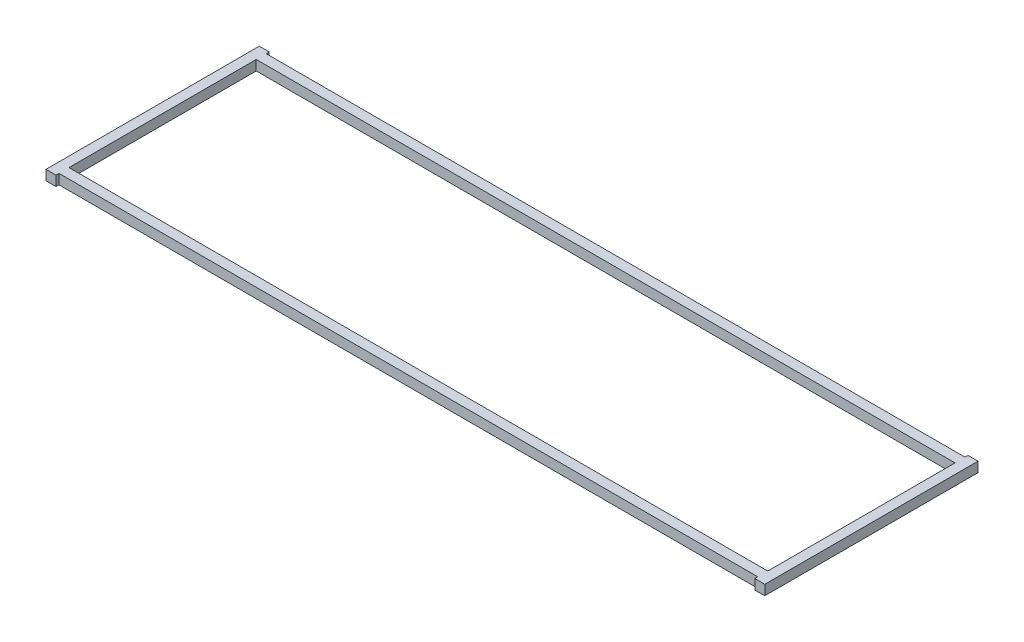
ISO-10303-21;
HEADER;
FILE_DESCRIPTION(('STEP AP214'),'2;1');
FILE_NAME('part.step','',(''),(''),'','','');
FILE_SCHEMA(('AUTOMOTIVE_DESIGN { 1 0 10303 214 1 1 1 1 }'));
ENDSEC;
DATA;
#1=APPLICATION_CONTEXT('core data for automotive mechanical design processes');
#2=APPLICATION_PROTOCOL_DEFINITION('international standard','automotive_design',2000,#1);
#3=PRODUCT_CONTEXT('',#1,'mechanical');
#4=PRODUCT('Part','Part','',(#3));
#5=PRODUCT_RELATED_PRODUCT_CATEGORY('part','',(#4));
#6=PRODUCT_DEFINITION_FORMATION('','',#4);
#7=PRODUCT_DEFINITION_CONTEXT('part definition',#1,'design');
#8=PRODUCT_DEFINITION('design','',#6,#7);
#9=PRODUCT_DEFINITION_SHAPE('','',#8);
#10=(LENGTH_UNIT() NAMED_UNIT(*) SI_UNIT(.MILLI.,.METRE.));
#11=(NAMED_UNIT(*) PLANE_ANGLE_UNIT() SI_UNIT($,.RADIAN.));
#12=(NAMED_UNIT(*) SI_UNIT($,.STERADIAN.) SOLID_ANGLE_UNIT());
#13=UNCERTAINTY_MEASURE_WITH_UNIT(LENGTH_MEASURE(1.E-05),#10,'distance_accuracy_value','');
#14=(GEOMETRIC_REPRESENTATION_CONTEXT(3) GLOBAL_UNCERTAINTY_ASSIGNED_CONTEXT((#13)) GLOBAL_UNIT_ASSIGNED_CONTEXT((#10,
#11,#12)) REPRESENTATION_CONTEXT('',''));
#15=CARTESIAN_POINT('',(0.,0.,0.));
#16=DIRECTION('',(0.,0.,1.));
#17=DIRECTION('',(1.,0.,0.));
#18=AXIS2_PLACEMENT_3D('',#15,#16,#17);
#19=CARTESIAN_POINT('',(0.,6.35,0.));
#20=DIRECTION('',(0.,-1.,0.));
#21=DIRECTION('',(0.,0.,-1.));
#22=AXIS2_PLACEMENT_3D('',#19,#20,#21);
#23=PLANE('',#22);
#24=DIRECTION('',(1.,0.,0.));
#25=VECTOR('',#24,1.);
#26=CARTESIAN_POINT('',(222.25,6.35,67.821175));
#27=LINE('',#26,#25);
#28=CARTESIAN_POINT('',(222.25,6.35,67.821175));
#29=VERTEX_POINT('',#28);
#30=CARTESIAN_POINT('',(228.6,6.35,67.821175));
#31=VERTEX_POINT('',#30);
#32=EDGE_CURVE('E186',#29,#31,#27,.T.);
#33=ORIENTED_EDGE('',*,*,#32,.T.);
#34=DIRECTION('',(0.,0.,-1.));
#35=VECTOR('',#34,1.);
#36=CARTESIAN_POINT('',(228.6,6.35,-67.821175));
#37=LINE('',#36,#35);
#38=CARTESIAN_POINT('',(228.6,6.35,-67.821175));
#39=VERTEX_POINT('',#38);
#40=EDGE_CURVE('E189',#31,#39,#37,.T.);
#41=ORIENTED_EDGE('',*,*,#40,.T.);
#42=DIRECTION('',(-1.,0.,0.));
#43=VECTOR('',#42,1.);
#44=CARTESIAN_POINT('',(222.25,6.35,-67.821175));
#45=LINE('',#44,#43);
#46=CARTESIAN_POINT('',(222.25,6.35,-67.821175));
#47=VERTEX_POINT('',#46);
#48=EDGE_CURVE('E192',#39,#47,#45,.T.);
#49=ORIENTED_EDGE('',*,*,#48,.T.);
#50=DIRECTION('',(0.,0.,1.));
#51=VECTOR('',#50,1.);
#52=CARTESIAN_POINT('',(222.25,6.35,-67.821175));
#53=LINE('',#52,#51);
#54=CARTESIAN_POINT('',(222.25,6.35,-65.913));
#55=VERTEX_POINT('',#54);
#56=EDGE_CURVE('E194',#47,#55,#53,.T.);
#57=ORIENTED_EDGE('',*,*,#56,.T.);
#58=DIRECTION('',(-1.,0.,0.));
#59=VECTOR('',#58,1.);
#60=CARTESIAN_POINT('',(-222.25,6.35,-65.913));
#61=LINE('',#60,#59);
#62=CARTESIAN_POINT('',(-222.25,6.35,-65.913));
#63=VERTEX_POINT('',#62);
#64=EDGE_CURVE('E196',#55,#63,#61,.T.);
#65=ORIENTED_EDGE('',*,*,#64,.T.);
#66=DIRECTION('',(0.,0.,-1.));
#67=VECTOR('',#66,1.);
#68=CARTESIAN_POINT('',(-222.25,6.35,-67.821175));
#69=LINE('',#68,#67);
#70=CARTESIAN_POINT('',(-222.25,6.35,-67.821175));
#71=VERTEX_POINT('',#70);
#72=EDGE_CURVE('E198',#63,#71,#69,.T.);
#73=ORIENTED_EDGE('',*,*,#72,.T.);
#74=DIRECTION('',(-1.,0.,0.));
#75=VECTOR('',#74,1.);
#76=CARTESIAN_POINT('',(-228.6,6.35,-67.821175));
#77=LINE('',#76,#75);
#78=CARTESIAN_POINT('',(-228.6,6.35,-67.821175));
#79=VERTEX_POINT('',#78);
#80=EDGE_CURVE('E200',#71,#79,#77,.T.);
#81=ORIENTED_EDGE('',*,*,#80,.T.);
#82=DIRECTION('',(0.,0.,1.));
#83=VECTOR('',#82,1.);
#84=CARTESIAN_POINT('',(-228.6,6.35,-67.821175));
#85=LINE('',#84,#83);
#86=CARTESIAN_POINT('',(-228.6,6.35,67.821175));
#87=VERTEX_POINT('',#86);
#88=EDGE_CURVE('E202',#79,#87,#85,.T.);
#89=ORIENTED_EDGE('',*,*,#88,.T.);
#90=DIRECTION('',(1.,0.,0.));
#91=VECTOR('',#90,1.);
#92=CARTESIAN_POINT('',(-228.6,6.35,67.821175));
#93=LINE('',#92,#91);
#94=CARTESIAN_POINT('',(-222.25,6.35,67.821175));
#95=VERTEX_POINT('',#94);
#96=EDGE_CURVE('E204',#87,#95,#93,.T.);
#97=ORIENTED_EDGE('',*,*,#96,.T.);
#98=DIRECTION('',(0.,0.,-1.));
#99=VECTOR('',#98,1.);
#100=CARTESIAN_POINT('',(-222.25,6.35,67.821175));
#101=LINE('',#100,#99);
#102=CARTESIAN_POINT('',(-222.25,6.35,65.913));
#103=VERTEX_POINT('',#102);
#104=EDGE_CURVE('E206',#95,#103,#101,.T.);
#105=ORIENTED_EDGE('',*,*,#104,.T.);
#106=DIRECTION('',(1.,0.,0.));
#107=VECTOR('',#106,1.);
#108=CARTESIAN_POINT('',(-222.25,6.35,65.913));
#109=LINE('',#108,#107);
#110=CARTESIAN_POINT('',(222.25,6.35,65.913));
#111=VERTEX_POINT('',#110);
#112=EDGE_CURVE('E208',#103,#111,#109,.T.);
#113=ORIENTED_EDGE('',*,*,#112,.T.);
#114=DIRECTION('',(0.,0.,1.));
#115=VECTOR('',#114,1.);
#116=CARTESIAN_POINT('',(222.25,6.35,67.821175));
#117=LINE('',#116,#115);
#118=EDGE_CURVE('E210',#111,#29,#117,.T.);
#119=ORIENTED_EDGE('',*,*,#118,.T.);
#120=EDGE_LOOP('',(#33,#41,#49,#57,#65,#73,#81,#89,#97,#105,#113,#119));
#121=FACE_BOUND('',#120,.T.);
#122=DIRECTION('',(0.,0.,-1.));
#123=VECTOR('',#122,1.);
#124=CARTESIAN_POINT('',(222.25,6.35,59.563));
#125=LINE('',#124,#123);
#126=CARTESIAN_POINT('',(222.25,6.35,59.563));
#127=VERTEX_POINT('',#126);
#128=CARTESIAN_POINT('',(222.25,6.35,-59.563));
#129=VERTEX_POINT('',#128);
#130=EDGE_CURVE('E150',#127,#129,#125,.T.);
#131=ORIENTED_EDGE('',*,*,#130,.F.);
#132=DIRECTION('',(1.,0.,0.));
#133=VECTOR('',#132,1.);
#134=CARTESIAN_POINT('',(-222.25,6.35,59.563));
#135=LINE('',#134,#133);
#136=CARTESIAN_POINT('',(-222.25,6.35,59.563));
#137=VERTEX_POINT('',#136);
#138=EDGE_CURVE('E172',#137,#127,#135,.T.);
#139=ORIENTED_EDGE('',*,*,#138,.F.);
#140=DIRECTION('',(0.,0.,1.));
#141=VECTOR('',#140,1.);
#142=CARTESIAN_POINT('',(-222.25,6.35,59.563));
#143=LINE('',#142,#141);
#144=CARTESIAN_POINT('',(-222.25,6.35,-59.563));
#145=VERTEX_POINT('',#144);
#146=EDGE_CURVE('E170',#145,#137,#143,.T.);
#147=ORIENTED_EDGE('',*,*,#146,.F.);
#148=DIRECTION('',(-1.,0.,0.));
#149=VECTOR('',#148,1.);
#150=CARTESIAN_POINT('',(-222.25,6.35,-59.563));
#151=LINE('',#150,#149);
#152=EDGE_CURVE('E158',#129,#145,#151,.T.);
#153=ORIENTED_EDGE('',*,*,#152,.F.);
#154=EDGE_LOOP('',(#131,#139,#147,#153));
#155=FACE_BOUND('',#154,.T.);
#156=ADVANCED_FACE('F37',(#121,#155),#23,.F.);
#157=CARTESIAN_POINT('',(0.,0.,0.));
#158=DIRECTION('',(0.,-1.,0.));
#159=DIRECTION('',(0.,0.,-1.));
#160=AXIS2_PLACEMENT_3D('',#157,#158,#159);
#161=PLANE('',#160);
#162=DIRECTION('',(1.,0.,0.));
#163=VECTOR('',#162,1.);
#164=CARTESIAN_POINT('',(222.25,0.,67.821175));
#165=LINE('',#164,#163);
#166=CARTESIAN_POINT('',(222.25,0.,67.821175));
#167=VERTEX_POINT('',#166);
#168=CARTESIAN_POINT('',(228.6,0.,67.821175));
#169=VERTEX_POINT('',#168);
#170=EDGE_CURVE('E166',#167,#169,#165,.T.);
#171=ORIENTED_EDGE('',*,*,#170,.F.);
#172=DIRECTION('',(0.,0.,1.));
#173=VECTOR('',#172,1.);
#174=CARTESIAN_POINT('',(222.25,0.,67.821175));
#175=LINE('',#174,#173);
#176=CARTESIAN_POINT('',(222.25,0.,65.913));
#177=VERTEX_POINT('',#176);
#178=EDGE_CURVE('E190',#177,#167,#175,.T.);
#179=ORIENTED_EDGE('',*,*,#178,.F.);
#180=DIRECTION('',(1.,0.,0.));
#181=VECTOR('',#180,1.);
#182=CARTESIAN_POINT('',(-222.25,0.,65.913));
#183=LINE('',#182,#181);
#184=CARTESIAN_POINT('',(-222.25,0.,65.913));
#185=VERTEX_POINT('',#184);
#186=EDGE_CURVE('E233',#185,#177,#183,.T.);
#187=ORIENTED_EDGE('',*,*,#186,.F.);
#188=DIRECTION('',(0.,0.,-1.));
#189=VECTOR('',#188,1.);
#190=CARTESIAN_POINT('',(-222.25,0.,67.821175));
#191=LINE('',#190,#189);
#192=CARTESIAN_POINT('',(-222.25,0.,67.821175));
#193=VERTEX_POINT('',#192);
#194=EDGE_CURVE('E231',#193,#185,#191,.T.);
#195=ORIENTED_EDGE('',*,*,#194,.F.);
#196=DIRECTION('',(1.,0.,0.));
#197=VECTOR('',#196,1.);
#198=CARTESIAN_POINT('',(-228.6,0.,67.821175));
#199=LINE('',#198,#197);
#200=CARTESIAN_POINT('',(-228.6,0.,67.821175));
#201=VERTEX_POINT('',#200);
#202=EDGE_CURVE('E229',#201,#193,#199,.T.);
#203=ORIENTED_EDGE('',*,*,#202,.F.);
#204=DIRECTION('',(0.,0.,1.));
#205=VECTOR('',#204,1.);
#206=CARTESIAN_POINT('',(-228.6,0.,-67.821175));
#207=LINE('',#206,#205);
#208=CARTESIAN_POINT('',(-228.6,0.,-67.821175));
#209=VERTEX_POINT('',#208);
#210=EDGE_CURVE('E227',#209,#201,#207,.T.);
#211=ORIENTED_EDGE('',*,*,#210,.F.);
#212=DIRECTION('',(-1.,0.,0.));
#213=VECTOR('',#212,1.);
#214=CARTESIAN_POINT('',(-228.6,0.,-67.821175));
#215=LINE('',#214,#213);
#216=CARTESIAN_POINT('',(-222.25,0.,-67.821175));
#217=VERTEX_POINT('',#216);
#218=EDGE_CURVE('E225',#217,#209,#215,.T.);
#219=ORIENTED_EDGE('',*,*,#218,.F.);
#220=DIRECTION('',(0.,0.,-1.));
#221=VECTOR('',#220,1.);
#222=CARTESIAN_POINT('',(-222.25,0.,-67.821175));
#223=LINE('',#222,#221);
#224=CARTESIAN_POINT('',(-222.25,0.,-65.913));
#225=VERTEX_POINT('',#224);
#226=EDGE_CURVE('E223',#225,#217,#223,.T.);
#227=ORIENTED_EDGE('',*,*,#226,.F.);
#228=DIRECTION('',(-1.,0.,0.));
#229=VECTOR('',#228,1.);
#230=CARTESIAN_POINT('',(-222.25,0.,-65.913));
#231=LINE('',#230,#229);
#232=CARTESIAN_POINT('',(222.25,0.,-65.913));
#233=VERTEX_POINT('',#232);
#234=EDGE_CURVE('E221',#233,#225,#231,.T.);
#235=ORIENTED_EDGE('',*,*,#234,.F.);
#236=DIRECTION('',(0.,0.,1.));
#237=VECTOR('',#236,1.);
#238=CARTESIAN_POINT('',(222.25,0.,-67.821175));
#239=LINE('',#238,#237);
#240=CARTESIAN_POINT('',(222.25,0.,-67.821175));
#241=VERTEX_POINT('',#240);
#242=EDGE_CURVE('E219',#241,#233,#239,.T.);
#243=ORIENTED_EDGE('',*,*,#242,.F.);
#244=DIRECTION('',(-1.,0.,0.));
#245=VECTOR('',#244,1.);
#246=CARTESIAN_POINT('',(222.25,0.,-67.821175));
#247=LINE('',#246,#245);
#248=CARTESIAN_POINT('',(228.6,0.,-67.821175));
#249=VERTEX_POINT('',#248);
#250=EDGE_CURVE('E217',#249,#241,#247,.T.);
#251=ORIENTED_EDGE('',*,*,#250,.F.);
#252=DIRECTION('',(0.,0.,-1.));
#253=VECTOR('',#252,1.);
#254=CARTESIAN_POINT('',(228.6,0.,-67.821175));
#255=LINE('',#254,#253);
#256=EDGE_CURVE('E215',#169,#249,#255,.T.);
#257=ORIENTED_EDGE('',*,*,#256,.F.);
#258=EDGE_LOOP('',(#171,#179,#187,#195,#203,#211,#219,#227,#235,#243,#251,#257));
#259=FACE_BOUND('',#258,.T.);
#260=DIRECTION('',(1.,0.,0.));
#261=VECTOR('',#260,1.);
#262=CARTESIAN_POINT('',(-222.25,0.,59.563));
#263=LINE('',#262,#261);
#264=CARTESIAN_POINT('',(-222.25,0.,59.563));
#265=VERTEX_POINT('',#264);
#266=CARTESIAN_POINT('',(222.25,0.,59.563));
#267=VERTEX_POINT('',#266);
#268=EDGE_CURVE('E159',#265,#267,#263,.T.);
#269=ORIENTED_EDGE('',*,*,#268,.T.);
#270=DIRECTION('',(0.,0.,-1.));
#271=VECTOR('',#270,1.);
#272=CARTESIAN_POINT('',(222.25,0.,59.563));
#273=LINE('',#272,#271);
#274=CARTESIAN_POINT('',(222.25,0.,-59.563));
#275=VERTEX_POINT('',#274);
#276=EDGE_CURVE('E60',#267,#275,#273,.T.);
#277=ORIENTED_EDGE('',*,*,#276,.T.);
#278=DIRECTION('',(-1.,0.,0.));
#279=VECTOR('',#278,1.);
#280=CARTESIAN_POINT('',(-222.25,0.,-59.563));
#281=LINE('',#280,#279);
#282=CARTESIAN_POINT('',(-222.25,0.,-59.563));
#283=VERTEX_POINT('',#282);
#284=EDGE_CURVE('E165',#275,#283,#281,.T.);
#285=ORIENTED_EDGE('',*,*,#284,.T.);
#286=DIRECTION('',(0.,0.,1.));
#287=VECTOR('',#286,1.);
#288=CARTESIAN_POINT('',(-222.25,0.,59.563));
#289=LINE('',#288,#287);
#290=EDGE_CURVE('E178',#283,#265,#289,.T.);
#291=ORIENTED_EDGE('',*,*,#290,.T.);
#292=EDGE_LOOP('',(#269,#277,#285,#291));
#293=FACE_BOUND('',#292,.T.);
#294=ADVANCED_FACE('F275',(#259,#293),#161,.T.);
#295=CARTESIAN_POINT('',(222.25,6.35,67.821175));
#296=DIRECTION('',(0.,0.,-1.));
#297=DIRECTION('',(-1.,0.,0.));
#298=AXIS2_PLACEMENT_3D('',#295,#296,#297);
#299=PLANE('',#298);
#300=ORIENTED_EDGE('',*,*,#170,.T.);
#301=DIRECTION('',(0.,-1.,0.));
#302=VECTOR('',#301,1.);
#303=CARTESIAN_POINT('',(228.6,6.35,67.821175));
#304=LINE('',#303,#302);
#305=EDGE_CURVE('E11',#31,#169,#304,.T.);
#306=ORIENTED_EDGE('',*,*,#305,.F.);
#307=ORIENTED_EDGE('',*,*,#32,.F.);
#308=DIRECTION('',(0.,-1.,0.));
#309=VECTOR('',#308,1.);
#310=CARTESIAN_POINT('',(222.25,6.35,67.821175));
#311=LINE('',#310,#309);
#312=EDGE_CURVE('E212',#29,#167,#311,.T.);
#313=ORIENTED_EDGE('',*,*,#312,.T.);
#314=EDGE_LOOP('',(#300,#306,#307,#313));
#315=FACE_BOUND('',#314,.T.);
#316=ADVANCED_FACE('F39',(#315),#299,.F.);
#317=CARTESIAN_POINT('',(228.6,6.35,-67.821175));
#318=DIRECTION('',(-1.,0.,0.));
#319=DIRECTION('',(0.,0.,1.));
#320=AXIS2_PLACEMENT_3D('',#317,#318,#319);
#321=PLANE('',#320);
#322=ORIENTED_EDGE('',*,*,#256,.T.);
#323=DIRECTION('',(0.,-1.,0.));
#324=VECTOR('',#323,1.);
#325=CARTESIAN_POINT('',(228.6,6.35,-67.821175));
#326=LINE('',#325,#324);
#327=EDGE_CURVE('E45',#39,#249,#326,.T.);
#328=ORIENTED_EDGE('',*,*,#327,.F.);
#329=ORIENTED_EDGE('',*,*,#40,.F.);
#330=ORIENTED_EDGE('',*,*,#305,.T.);
#331=EDGE_LOOP('',(#322,#328,#329,#330));
#332=FACE_BOUND('',#331,.T.);
#333=ADVANCED_FACE('F292',(#332),#321,.F.);
#334=CARTESIAN_POINT('',(222.25,6.35,-67.821175));
#335=DIRECTION('',(0.,0.,1.));
#336=DIRECTION('',(1.,0.,0.));
#337=AXIS2_PLACEMENT_3D('',#334,#335,#336);
#338=PLANE('',#337);
#339=ORIENTED_EDGE('',*,*,#250,.T.);
#340=DIRECTION('',(0.,-1.,0.));
#341=VECTOR('',#340,1.);
#342=CARTESIAN_POINT('',(222.25,6.35,-67.821175));
#343=LINE('',#342,#341);
#344=EDGE_CURVE('E262',#47,#241,#343,.T.);
#345=ORIENTED_EDGE('',*,*,#344,.F.);
#346=ORIENTED_EDGE('',*,*,#48,.F.);
#347=ORIENTED_EDGE('',*,*,#327,.T.);
#348=EDGE_LOOP('',(#339,#345,#346,#347));
#349=FACE_BOUND('',#348,.T.);
#350=ADVANCED_FACE('F269',(#349),#338,.F.);
#351=CARTESIAN_POINT('',(222.25,6.35,-67.821175));
#352=DIRECTION('',(1.,0.,0.));
#353=DIRECTION('',(0.,0.,-1.));
#354=AXIS2_PLACEMENT_3D('',#351,#352,#353);
#355=PLANE('',#354);
#356=ORIENTED_EDGE('',*,*,#242,.T.);
#357=DIRECTION('',(0.,-1.,0.));
#358=VECTOR('',#357,1.);
#359=CARTESIAN_POINT('',(222.25,6.35,-65.913));
#360=LINE('',#359,#358);
#361=EDGE_CURVE('E259',#55,#233,#360,.T.);
#362=ORIENTED_EDGE('',*,*,#361,.F.);
#363=ORIENTED_EDGE('',*,*,#56,.F.);
#364=ORIENTED_EDGE('',*,*,#344,.T.);
#365=EDGE_LOOP('',(#356,#362,#363,#364));
#366=FACE_BOUND('',#365,.T.);
#367=ADVANCED_FACE('F281',(#366),#355,.F.);
#368=CARTESIAN_POINT('',(-222.25,6.35,-65.913));
#369=DIRECTION('',(0.,0.,1.));
#370=DIRECTION('',(1.,0.,0.));
#371=AXIS2_PLACEMENT_3D('',#368,#369,#370);
#372=PLANE('',#371);
#373=ORIENTED_EDGE('',*,*,#234,.T.);
#374=DIRECTION('',(0.,-1.,0.));
#375=VECTOR('',#374,1.);
#376=CARTESIAN_POINT('',(-222.25,6.35,-65.913));
#377=LINE('',#376,#375);
#378=EDGE_CURVE('E256',#63,#225,#377,.T.);
#379=ORIENTED_EDGE('',*,*,#378,.F.);
#380=ORIENTED_EDGE('',*,*,#64,.F.);
#381=ORIENTED_EDGE('',*,*,#361,.T.);
#382=EDGE_LOOP('',(#373,#379,#380,#381));
#383=FACE_BOUND('',#382,.T.);
#384=ADVANCED_FACE('F285',(#383),#372,.F.);
#385=CARTESIAN_POINT('',(-222.25,6.35,-67.821175));
#386=DIRECTION('',(-1.,0.,0.));
#387=DIRECTION('',(0.,0.,1.));
#388=AXIS2_PLACEMENT_3D('',#385,#386,#387);
#389=PLANE('',#388);
#390=ORIENTED_EDGE('',*,*,#226,.T.);
#391=DIRECTION('',(0.,-1.,0.));
#392=VECTOR('',#391,1.);
#393=CARTESIAN_POINT('',(-222.25,6.35,-67.821175));
#394=LINE('',#393,#392);
#395=EDGE_CURVE('E253',#71,#217,#394,.T.);
#396=ORIENTED_EDGE('',*,*,#395,.F.);
#397=ORIENTED_EDGE('',*,*,#72,.F.);
#398=ORIENTED_EDGE('',*,*,#378,.T.);
#399=EDGE_LOOP('',(#390,#396,#397,#398));
#400=FACE_BOUND('',#399,.T.);
#401=ADVANCED_FACE('F325',(#400),#389,.F.);
#402=CARTESIAN_POINT('',(-228.6,6.35,-67.821175));
#403=DIRECTION('',(0.,0.,1.));
#404=DIRECTION('',(1.,0.,0.));
#405=AXIS2_PLACEMENT_3D('',#402,#403,#404);
#406=PLANE('',#405);
#407=ORIENTED_EDGE('',*,*,#218,.T.);
#408=DIRECTION('',(0.,-1.,0.));
#409=VECTOR('',#408,1.);
#410=CARTESIAN_POINT('',(-228.6,6.35,-67.821175));
#411=LINE('',#410,#409);
#412=EDGE_CURVE('E250',#79,#209,#411,.T.);
#413=ORIENTED_EDGE('',*,*,#412,.F.);
#414=ORIENTED_EDGE('',*,*,#80,.F.);
#415=ORIENTED_EDGE('',*,*,#395,.T.);
#416=EDGE_LOOP('',(#407,#413,#414,#415));
#417=FACE_BOUND('',#416,.T.);
#418=ADVANCED_FACE('F323',(#417),#406,.F.);
#419=CARTESIAN_POINT('',(-228.6,6.35,-67.821175));
#420=DIRECTION('',(1.,0.,0.));
#421=DIRECTION('',(0.,0.,-1.));
#422=AXIS2_PLACEMENT_3D('',#419,#420,#421);
#423=PLANE('',#422);
#424=ORIENTED_EDGE('',*,*,#210,.T.);
#425=DIRECTION('',(0.,-1.,0.));
#426=VECTOR('',#425,1.);
#427=CARTESIAN_POINT('',(-228.6,6.35,67.821175));
#428=LINE('',#427,#426);
#429=EDGE_CURVE('E247',#87,#201,#428,.T.);
#430=ORIENTED_EDGE('',*,*,#429,.F.);
#431=ORIENTED_EDGE('',*,*,#88,.F.);
#432=ORIENTED_EDGE('',*,*,#412,.T.);
#433=EDGE_LOOP('',(#424,#430,#431,#432));
#434=FACE_BOUND('',#433,.T.);
#435=ADVANCED_FACE('F319',(#434),#423,.F.);
#436=CARTESIAN_POINT('',(-228.6,6.35,67.821175));
#437=DIRECTION('',(0.,0.,-1.));
#438=DIRECTION('',(-1.,0.,0.));
#439=AXIS2_PLACEMENT_3D('',#436,#437,#438);
#440=PLANE('',#439);
#441=ORIENTED_EDGE('',*,*,#202,.T.);
#442=DIRECTION('',(0.,-1.,0.));
#443=VECTOR('',#442,1.);
#444=CARTESIAN_POINT('',(-222.25,6.35,67.821175));
#445=LINE('',#444,#443);
#446=EDGE_CURVE('E244',#95,#193,#445,.T.);
#447=ORIENTED_EDGE('',*,*,#446,.F.);
#448=ORIENTED_EDGE('',*,*,#96,.F.);
#449=ORIENTED_EDGE('',*,*,#429,.T.);
#450=EDGE_LOOP('',(#441,#447,#448,#449));
#451=FACE_BOUND('',#450,.T.);
#452=ADVANCED_FACE('F314',(#451),#440,.F.);
#453=CARTESIAN_POINT('',(-222.25,6.35,67.821175));
#454=DIRECTION('',(-1.,0.,0.));
#455=DIRECTION('',(0.,0.,1.));
#456=AXIS2_PLACEMENT_3D('',#453,#454,#455);
#457=PLANE('',#456);
#458=ORIENTED_EDGE('',*,*,#194,.T.);
#459=DIRECTION('',(0.,-1.,0.));
#460=VECTOR('',#459,1.);
#461=CARTESIAN_POINT('',(-222.25,6.35,65.913));
#462=LINE('',#461,#460);
#463=EDGE_CURVE('E241',#103,#185,#462,.T.);
#464=ORIENTED_EDGE('',*,*,#463,.F.);
#465=ORIENTED_EDGE('',*,*,#104,.F.);
#466=ORIENTED_EDGE('',*,*,#446,.T.);
#467=EDGE_LOOP('',(#458,#464,#465,#466));
#468=FACE_BOUND('',#467,.T.);
#469=ADVANCED_FACE('F308',(#468),#457,.F.);
#470=CARTESIAN_POINT('',(-222.25,6.35,65.913));
#471=DIRECTION('',(0.,0.,-1.));
#472=DIRECTION('',(-1.,0.,0.));
#473=AXIS2_PLACEMENT_3D('',#470,#471,#472);
#474=PLANE('',#473);
#475=ORIENTED_EDGE('',*,*,#186,.T.);
#476=DIRECTION('',(0.,-1.,0.));
#477=VECTOR('',#476,1.);
#478=CARTESIAN_POINT('',(222.25,6.35,65.913));
#479=LINE('',#478,#477);
#480=EDGE_CURVE('E238',#111,#177,#479,.T.);
#481=ORIENTED_EDGE('',*,*,#480,.F.);
#482=ORIENTED_EDGE('',*,*,#112,.F.);
#483=ORIENTED_EDGE('',*,*,#463,.T.);
#484=EDGE_LOOP('',(#475,#481,#482,#483));
#485=FACE_BOUND('',#484,.T.);
#486=ADVANCED_FACE('F304',(#485),#474,.F.);
#487=CARTESIAN_POINT('',(222.25,6.35,67.821175));
#488=DIRECTION('',(1.,0.,0.));
#489=DIRECTION('',(0.,0.,-1.));
#490=AXIS2_PLACEMENT_3D('',#487,#488,#489);
#491=PLANE('',#490);
#492=ORIENTED_EDGE('',*,*,#178,.T.);
#493=ORIENTED_EDGE('',*,*,#312,.F.);
#494=ORIENTED_EDGE('',*,*,#118,.F.);
#495=ORIENTED_EDGE('',*,*,#480,.T.);
#496=EDGE_LOOP('',(#492,#493,#494,#495));
#497=FACE_BOUND('',#496,.T.);
#498=ADVANCED_FACE('F299',(#497),#491,.F.);
#499=CARTESIAN_POINT('',(222.25,6.35,59.563));
#500=DIRECTION('',(-1.,0.,0.));
#501=DIRECTION('',(0.,0.,1.));
#502=AXIS2_PLACEMENT_3D('',#499,#500,#501);
#503=PLANE('',#502);
#504=ORIENTED_EDGE('',*,*,#276,.F.);
#505=DIRECTION('',(0.,-1.,0.));
#506=VECTOR('',#505,1.);
#507=CARTESIAN_POINT('',(222.25,6.35,59.563));
#508=LINE('',#507,#506);
#509=EDGE_CURVE('E154',#127,#267,#508,.T.);
#510=ORIENTED_EDGE('',*,*,#509,.F.);
#511=ORIENTED_EDGE('',*,*,#130,.T.);
#512=DIRECTION('',(0.,-1.,0.));
#513=VECTOR('',#512,1.);
#514=CARTESIAN_POINT('',(222.25,6.35,-59.563));
#515=LINE('',#514,#513);
#516=EDGE_CURVE('E153',#129,#275,#515,.T.);
#517=ORIENTED_EDGE('',*,*,#516,.T.);
#518=EDGE_LOOP('',(#504,#510,#511,#517));
#519=FACE_BOUND('',#518,.T.);
#520=ADVANCED_FACE('F152',(#519),#503,.T.);
#521=CARTESIAN_POINT('',(-222.25,6.35,-59.563));
#522=DIRECTION('',(0.,0.,1.));
#523=DIRECTION('',(1.,0.,0.));
#524=AXIS2_PLACEMENT_3D('',#521,#522,#523);
#525=PLANE('',#524);
#526=ORIENTED_EDGE('',*,*,#284,.F.);
#527=ORIENTED_EDGE('',*,*,#516,.F.);
#528=ORIENTED_EDGE('',*,*,#152,.T.);
#529=DIRECTION('',(0.,-1.,0.));
#530=VECTOR('',#529,1.);
#531=CARTESIAN_POINT('',(-222.25,6.35,-59.563));
#532=LINE('',#531,#530);
#533=EDGE_CURVE('E167',#145,#283,#532,.T.);
#534=ORIENTED_EDGE('',*,*,#533,.T.);
#535=EDGE_LOOP('',(#526,#527,#528,#534));
#536=FACE_BOUND('',#535,.T.);
#537=ADVANCED_FACE('F162',(#536),#525,.T.);
#538=CARTESIAN_POINT('',(-222.25,6.35,59.563));
#539=DIRECTION('',(1.,0.,0.));
#540=DIRECTION('',(0.,0.,-1.));
#541=AXIS2_PLACEMENT_3D('',#538,#539,#540);
#542=PLANE('',#541);
#543=ORIENTED_EDGE('',*,*,#290,.F.);
#544=ORIENTED_EDGE('',*,*,#533,.F.);
#545=ORIENTED_EDGE('',*,*,#146,.T.);
#546=DIRECTION('',(0.,-1.,0.));
#547=VECTOR('',#546,1.);
#548=CARTESIAN_POINT('',(-222.25,6.35,59.563));
#549=LINE('',#548,#547);
#550=EDGE_CURVE('E52',#137,#265,#549,.T.);
#551=ORIENTED_EDGE('',*,*,#550,.T.);
#552=EDGE_LOOP('',(#543,#544,#545,#551));
#553=FACE_BOUND('',#552,.T.);
#554=ADVANCED_FACE('F383',(#553),#542,.T.);
#555=CARTESIAN_POINT('',(-222.25,6.35,59.563));
#556=DIRECTION('',(0.,0.,-1.));
#557=DIRECTION('',(-1.,0.,0.));
#558=AXIS2_PLACEMENT_3D('',#555,#556,#557);
#559=PLANE('',#558);
#560=ORIENTED_EDGE('',*,*,#268,.F.);
#561=ORIENTED_EDGE('',*,*,#550,.F.);
#562=ORIENTED_EDGE('',*,*,#138,.T.);
#563=ORIENTED_EDGE('',*,*,#509,.T.);
#564=EDGE_LOOP('',(#560,#561,#562,#563));
#565=FACE_BOUND('',#564,.T.);
#566=ADVANCED_FACE('F389',(#565),#559,.T.);
#567=CLOSED_SHELL('',(#156,#294,#316,#333,#350,#367,#384,#401,#418,#435,#452,#469,#486,#498,
#520,#537,#554,#566));
#568=MANIFOLD_SOLID_BREP('B2',#567);
#569=ADVANCED_BREP_SHAPE_REPRESENTATION('',(#18,#568),#14);
#570=SHAPE_DEFINITION_REPRESENTATION(#9,#569);
ENDSEC;
END-ISO-10303-21;
